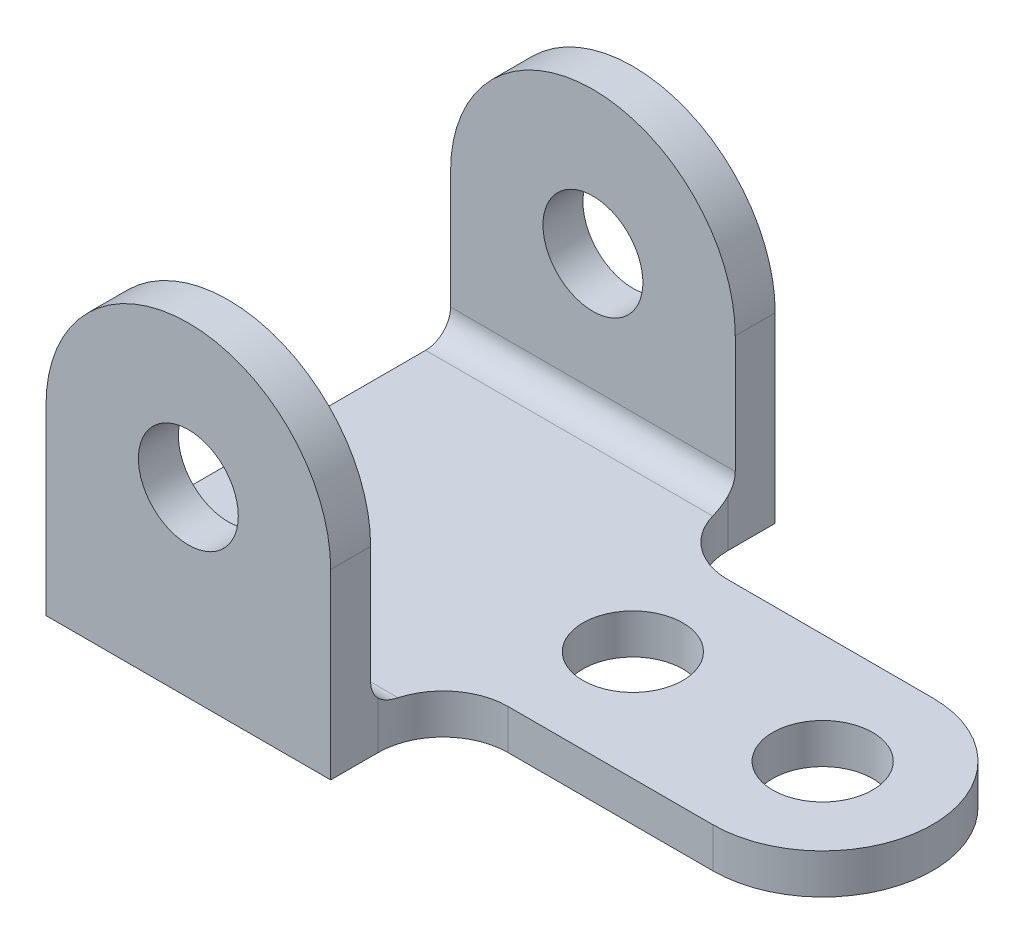
ISO-10303-21;
HEADER;
FILE_DESCRIPTION(('STEP AP214'),'2;1');
FILE_NAME('part.step','',(''),(''),'','','');
FILE_SCHEMA(('AUTOMOTIVE_DESIGN { 1 0 10303 214 1 1 1 1 }'));
ENDSEC;
DATA;
#1=APPLICATION_CONTEXT('core data for automotive mechanical design processes');
#2=APPLICATION_PROTOCOL_DEFINITION('international standard','automotive_design',2000,#1);
#3=PRODUCT_CONTEXT('',#1,'mechanical');
#4=PRODUCT('Part','Part','',(#3));
#5=PRODUCT_RELATED_PRODUCT_CATEGORY('part','',(#4));
#6=PRODUCT_DEFINITION_FORMATION('','',#4);
#7=PRODUCT_DEFINITION_CONTEXT('part definition',#1,'design');
#8=PRODUCT_DEFINITION('design','',#6,#7);
#9=PRODUCT_DEFINITION_SHAPE('','',#8);
#10=(LENGTH_UNIT() NAMED_UNIT(*) SI_UNIT(.MILLI.,.METRE.));
#11=(NAMED_UNIT(*) PLANE_ANGLE_UNIT() SI_UNIT($,.RADIAN.));
#12=(NAMED_UNIT(*) SI_UNIT($,.STERADIAN.) SOLID_ANGLE_UNIT());
#13=UNCERTAINTY_MEASURE_WITH_UNIT(LENGTH_MEASURE(1.E-05),#10,'distance_accuracy_value','');
#14=(GEOMETRIC_REPRESENTATION_CONTEXT(3) GLOBAL_UNCERTAINTY_ASSIGNED_CONTEXT((#13)) GLOBAL_UNIT_ASSIGNED_CONTEXT((#10,
#11,#12)) REPRESENTATION_CONTEXT('',''));
#15=CARTESIAN_POINT('',(0.,0.,0.));
#16=DIRECTION('',(0.,0.,1.));
#17=DIRECTION('',(1.,0.,0.));
#18=AXIS2_PLACEMENT_3D('',#15,#16,#17);
#19=CARTESIAN_POINT('',(70.,8.,-9.49999999999998));
#20=DIRECTION('',(0.,-1.,0.));
#21=DIRECTION('',(0.,0.,-1.));
#22=AXIS2_PLACEMENT_3D('',#19,#20,#21);
#23=PLANE('',#22);
#24=CARTESIAN_POINT('',(111.,8.,-44.5));
#25=DIRECTION('',(0.,1.,0.));
#26=DIRECTION('',(0.,0.,1.));
#27=AXIS2_PLACEMENT_3D('',#24,#25,#26);
#28=CIRCLE('',#27,10.);
#29=CARTESIAN_POINT('',(111.,8.,-34.5));
#30=VERTEX_POINT('',#29);
#31=EDGE_CURVE('E226',#30,#30,#28,.T.);
#32=ORIENTED_EDGE('',*,*,#31,.F.);
#33=EDGE_LOOP('',(#32));
#34=FACE_BOUND('',#33,.T.);
#35=CARTESIAN_POINT('',(73.,8.,-44.5));
#36=DIRECTION('',(0.,1.,0.));
#37=DIRECTION('',(0.,0.,1.));
#38=AXIS2_PLACEMENT_3D('',#35,#36,#37);
#39=CIRCLE('',#38,9.99999999999999);
#40=CARTESIAN_POINT('',(73.,8.,-34.5));
#41=VERTEX_POINT('',#40);
#42=EDGE_CURVE('E234',#41,#41,#39,.T.);
#43=ORIENTED_EDGE('',*,*,#42,.F.);
#44=EDGE_LOOP('',(#43));
#45=FACE_BOUND('',#44,.T.);
#46=CARTESIAN_POINT('',(70.,8.,-79.5));
#47=DIRECTION('',(0.,-1.,0.));
#48=DIRECTION('',(0.,0.,-1.));
#49=AXIS2_PLACEMENT_3D('',#46,#47,#48);
#50=CIRCLE('',#49,13.);
#51=CARTESIAN_POINT('',(70.,8.,-66.5));
#52=VERTEX_POINT('',#51);
#53=CARTESIAN_POINT('',(57.4800159744511,8.,-76.));
#54=VERTEX_POINT('',#53);
#55=EDGE_CURVE('E255',#52,#54,#50,.T.);
#56=ORIENTED_EDGE('',*,*,#55,.T.);
#57=DIRECTION('',(-1.,0.,0.));
#58=VECTOR('',#57,1.);
#59=CARTESIAN_POINT('',(0.,8.,-76.));
#60=LINE('',#59,#58);
#61=CARTESIAN_POINT('',(0.,8.,-76.));
#62=VERTEX_POINT('',#61);
#63=EDGE_CURVE('E331',#54,#62,#60,.T.);
#64=ORIENTED_EDGE('',*,*,#63,.T.);
#65=DIRECTION('',(0.,0.,1.));
#66=VECTOR('',#65,1.);
#67=CARTESIAN_POINT('',(0.,8.,0.));
#68=LINE('',#67,#66);
#69=CARTESIAN_POINT('',(0.,8.,-13.));
#70=VERTEX_POINT('',#69);
#71=EDGE_CURVE('E259',#62,#70,#68,.T.);
#72=ORIENTED_EDGE('',*,*,#71,.T.);
#73=DIRECTION('',(1.,0.,0.));
#74=VECTOR('',#73,1.);
#75=CARTESIAN_POINT('',(70.,8.,-13.));
#76=LINE('',#75,#74);
#77=CARTESIAN_POINT('',(57.4800159744511,8.,-13.));
#78=VERTEX_POINT('',#77);
#79=EDGE_CURVE('E327',#70,#78,#76,.T.);
#80=ORIENTED_EDGE('',*,*,#79,.T.);
#81=CARTESIAN_POINT('',(70.,8.,-9.49999999999998));
#82=DIRECTION('',(0.,-1.,0.));
#83=DIRECTION('',(0.,0.,-1.));
#84=AXIS2_PLACEMENT_3D('',#81,#82,#83);
#85=CIRCLE('',#84,13.);
#86=CARTESIAN_POINT('',(70.,8.,-22.5));
#87=VERTEX_POINT('',#86);
#88=EDGE_CURVE('E242',#78,#87,#85,.T.);
#89=ORIENTED_EDGE('',*,*,#88,.T.);
#90=DIRECTION('',(1.,0.,0.));
#91=VECTOR('',#90,1.);
#92=CARTESIAN_POINT('',(70.,8.,-22.5));
#93=LINE('',#92,#91);
#94=CARTESIAN_POINT('',(111.,8.,-22.5));
#95=VERTEX_POINT('',#94);
#96=EDGE_CURVE('E245',#87,#95,#93,.T.);
#97=ORIENTED_EDGE('',*,*,#96,.T.);
#98=CARTESIAN_POINT('',(111.,8.,-44.5));
#99=DIRECTION('',(0.,1.,0.));
#100=DIRECTION('',(0.,0.,-1.));
#101=AXIS2_PLACEMENT_3D('',#98,#99,#100);
#102=CIRCLE('',#101,22.);
#103=CARTESIAN_POINT('',(111.,8.,-66.5));
#104=VERTEX_POINT('',#103);
#105=EDGE_CURVE('E249',#95,#104,#102,.T.);
#106=ORIENTED_EDGE('',*,*,#105,.T.);
#107=DIRECTION('',(-1.,0.,0.));
#108=VECTOR('',#107,1.);
#109=CARTESIAN_POINT('',(111.,8.,-66.5));
#110=LINE('',#109,#108);
#111=EDGE_CURVE('E252',#104,#52,#110,.T.);
#112=ORIENTED_EDGE('',*,*,#111,.T.);
#113=EDGE_LOOP('',(#56,#64,#72,#80,#89,#97,#106,#112));
#114=FACE_BOUND('',#113,.T.);
#115=ADVANCED_FACE('F44',(#34,#45,#114),#23,.F.);
#116=CARTESIAN_POINT('',(70.,0.,-9.49999999999998));
#117=DIRECTION('',(0.,-1.,0.));
#118=DIRECTION('',(0.,0.,-1.));
#119=AXIS2_PLACEMENT_3D('',#116,#117,#118);
#120=PLANE('',#119);
#121=CARTESIAN_POINT('',(70.,0.,-9.49999999999998));
#122=DIRECTION('',(0.,-1.,0.));
#123=DIRECTION('',(0.,0.,-1.));
#124=AXIS2_PLACEMENT_3D('',#121,#122,#123);
#125=CIRCLE('',#124,13.);
#126=CARTESIAN_POINT('',(57.,0.,-9.49999999999998));
#127=VERTEX_POINT('',#126);
#128=CARTESIAN_POINT('',(70.,0.,-22.5));
#129=VERTEX_POINT('',#128);
#130=EDGE_CURVE('E270',#127,#129,#125,.T.);
#131=ORIENTED_EDGE('',*,*,#130,.F.);
#132=DIRECTION('',(0.,0.,-1.));
#133=VECTOR('',#132,1.);
#134=CARTESIAN_POINT('',(57.,0.,0.));
#135=LINE('',#134,#133);
#136=CARTESIAN_POINT('',(57.,0.,0.));
#137=VERTEX_POINT('',#136);
#138=EDGE_CURVE('E267',#137,#127,#135,.T.);
#139=ORIENTED_EDGE('',*,*,#138,.F.);
#140=DIRECTION('',(1.,0.,0.));
#141=VECTOR('',#140,1.);
#142=CARTESIAN_POINT('',(0.,0.,0.));
#143=LINE('',#142,#141);
#144=CARTESIAN_POINT('',(0.,0.,0.));
#145=VERTEX_POINT('',#144);
#146=EDGE_CURVE('E238',#145,#137,#143,.T.);
#147=ORIENTED_EDGE('',*,*,#146,.F.);
#148=DIRECTION('',(0.,0.,1.));
#149=VECTOR('',#148,1.);
#150=CARTESIAN_POINT('',(0.,0.,0.));
#151=LINE('',#150,#149);
#152=CARTESIAN_POINT('',(0.,0.,-89.));
#153=VERTEX_POINT('',#152);
#154=EDGE_CURVE('E246',#153,#145,#151,.T.);
#155=ORIENTED_EDGE('',*,*,#154,.F.);
#156=DIRECTION('',(-1.,0.,0.));
#157=VECTOR('',#156,1.);
#158=CARTESIAN_POINT('',(57.,0.,-89.));
#159=LINE('',#158,#157);
#160=CARTESIAN_POINT('',(57.,0.,-89.));
#161=VERTEX_POINT('',#160);
#162=EDGE_CURVE('E288',#161,#153,#159,.T.);
#163=ORIENTED_EDGE('',*,*,#162,.F.);
#164=DIRECTION('',(0.,0.,-1.));
#165=VECTOR('',#164,1.);
#166=CARTESIAN_POINT('',(57.,0.,-79.5));
#167=LINE('',#166,#165);
#168=CARTESIAN_POINT('',(57.,0.,-79.5));
#169=VERTEX_POINT('',#168);
#170=EDGE_CURVE('E285',#169,#161,#167,.T.);
#171=ORIENTED_EDGE('',*,*,#170,.F.);
#172=CARTESIAN_POINT('',(70.,0.,-79.5));
#173=DIRECTION('',(0.,-1.,0.));
#174=DIRECTION('',(0.,0.,-1.));
#175=AXIS2_PLACEMENT_3D('',#172,#173,#174);
#176=CIRCLE('',#175,13.);
#177=CARTESIAN_POINT('',(70.,0.,-66.5));
#178=VERTEX_POINT('',#177);
#179=EDGE_CURVE('E282',#178,#169,#176,.T.);
#180=ORIENTED_EDGE('',*,*,#179,.F.);
#181=DIRECTION('',(-1.,0.,0.));
#182=VECTOR('',#181,1.);
#183=CARTESIAN_POINT('',(111.,0.,-66.5));
#184=LINE('',#183,#182);
#185=CARTESIAN_POINT('',(111.,0.,-66.5));
#186=VERTEX_POINT('',#185);
#187=EDGE_CURVE('E279',#186,#178,#184,.T.);
#188=ORIENTED_EDGE('',*,*,#187,.F.);
#189=CARTESIAN_POINT('',(111.,0.,-44.5));
#190=DIRECTION('',(0.,1.,0.));
#191=DIRECTION('',(0.,0.,-1.));
#192=AXIS2_PLACEMENT_3D('',#189,#190,#191);
#193=CIRCLE('',#192,22.);
#194=CARTESIAN_POINT('',(111.,0.,-22.5));
#195=VERTEX_POINT('',#194);
#196=EDGE_CURVE('E276',#195,#186,#193,.T.);
#197=ORIENTED_EDGE('',*,*,#196,.F.);
#198=DIRECTION('',(1.,0.,0.));
#199=VECTOR('',#198,1.);
#200=CARTESIAN_POINT('',(70.,0.,-22.5));
#201=LINE('',#200,#199);
#202=EDGE_CURVE('E273',#129,#195,#201,.T.);
#203=ORIENTED_EDGE('',*,*,#202,.F.);
#204=EDGE_LOOP('',(#131,#139,#147,#155,#163,#171,#180,#188,#197,#203));
#205=FACE_BOUND('',#204,.T.);
#206=CARTESIAN_POINT('',(73.,0.,-44.5));
#207=DIRECTION('',(0.,1.,0.));
#208=DIRECTION('',(0.,0.,1.));
#209=AXIS2_PLACEMENT_3D('',#206,#207,#208);
#210=CIRCLE('',#209,9.99999999999999);
#211=CARTESIAN_POINT('',(73.,0.,-34.5));
#212=VERTEX_POINT('',#211);
#213=EDGE_CURVE('E230',#212,#212,#210,.T.);
#214=ORIENTED_EDGE('',*,*,#213,.T.);
#215=EDGE_LOOP('',(#214));
#216=FACE_BOUND('',#215,.T.);
#217=CARTESIAN_POINT('',(111.,0.,-44.5));
#218=DIRECTION('',(0.,1.,0.));
#219=DIRECTION('',(0.,0.,1.));
#220=AXIS2_PLACEMENT_3D('',#217,#218,#219);
#221=CIRCLE('',#220,10.);
#222=CARTESIAN_POINT('',(111.,0.,-34.5));
#223=VERTEX_POINT('',#222);
#224=EDGE_CURVE('E222',#223,#223,#221,.T.);
#225=ORIENTED_EDGE('',*,*,#224,.T.);
#226=EDGE_LOOP('',(#225));
#227=FACE_BOUND('',#226,.T.);
#228=ADVANCED_FACE('F374',(#205,#216,#227),#120,.T.);
#229=CARTESIAN_POINT('',(0.,8.,0.));
#230=DIRECTION('',(0.,0.,-1.));
#231=DIRECTION('',(-1.,0.,0.));
#232=AXIS2_PLACEMENT_3D('',#229,#230,#231);
#233=PLANE('',#232);
#234=ORIENTED_EDGE('',*,*,#146,.T.);
#235=DIRECTION('',(0.,-1.,0.));
#236=VECTOR('',#235,1.);
#237=CARTESIAN_POINT('',(57.,8.,0.));
#238=LINE('',#237,#236);
#239=CARTESIAN_POINT('',(57.,36.5,0.));
#240=VERTEX_POINT('',#239);
#241=EDGE_CURVE('E323',#240,#137,#238,.T.);
#242=ORIENTED_EDGE('',*,*,#241,.F.);
#243=CARTESIAN_POINT('',(28.5,36.5,0.));
#244=DIRECTION('',(0.,0.,1.));
#245=DIRECTION('',(-1.,0.,0.));
#246=AXIS2_PLACEMENT_3D('',#243,#244,#245);
#247=CIRCLE('',#246,28.5);
#248=CARTESIAN_POINT('',(0.,36.5,0.));
#249=VERTEX_POINT('',#248);
#250=EDGE_CURVE('E199',#240,#249,#247,.T.);
#251=ORIENTED_EDGE('',*,*,#250,.T.);
#252=DIRECTION('',(0.,-1.,0.));
#253=VECTOR('',#252,1.);
#254=CARTESIAN_POINT('',(0.,8.,0.));
#255=LINE('',#254,#253);
#256=EDGE_CURVE('E263',#249,#145,#255,.T.);
#257=ORIENTED_EDGE('',*,*,#256,.T.);
#258=EDGE_LOOP('',(#234,#242,#251,#257));
#259=FACE_BOUND('',#258,.T.);
#260=CARTESIAN_POINT('',(28.5,36.5,0.));
#261=DIRECTION('',(0.,0.,1.));
#262=DIRECTION('',(1.,0.,0.));
#263=AXIS2_PLACEMENT_3D('',#260,#261,#262);
#264=CIRCLE('',#263,10.);
#265=CARTESIAN_POINT('',(38.5,36.5,0.));
#266=VERTEX_POINT('',#265);
#267=EDGE_CURVE('E193',#266,#266,#264,.T.);
#268=ORIENTED_EDGE('',*,*,#267,.F.);
#269=EDGE_LOOP('',(#268));
#270=FACE_BOUND('',#269,.T.);
#271=ADVANCED_FACE('F370',(#259,#270),#233,.F.);
#272=CARTESIAN_POINT('',(57.,8.,0.));
#273=DIRECTION('',(-1.,0.,0.));
#274=DIRECTION('',(0.,0.,1.));
#275=AXIS2_PLACEMENT_3D('',#272,#273,#274);
#276=PLANE('',#275);
#277=DIRECTION('',(0.,-1.,0.));
#278=VECTOR('',#277,1.);
#279=CARTESIAN_POINT('',(57.,8.,-9.49999999999998));
#280=LINE('',#279,#278);
#281=CARTESIAN_POINT('',(57.,9.4292857857286,-9.49999999999998));
#282=VERTEX_POINT('',#281);
#283=EDGE_CURVE('E61',#282,#127,#280,.T.);
#284=ORIENTED_EDGE('',*,*,#283,.F.);
#285=CARTESIAN_POINT('',(57.,13.,-13.));
#286=DIRECTION('',(-1.,0.,0.));
#287=DIRECTION('',(0.,0.,1.));
#288=AXIS2_PLACEMENT_3D('',#285,#286,#287);
#289=CIRCLE('',#288,5.);
#290=CARTESIAN_POINT('',(57.,13.,-8.));
#291=VERTEX_POINT('',#290);
#292=EDGE_CURVE('E54',#282,#291,#289,.T.);
#293=ORIENTED_EDGE('',*,*,#292,.T.);
#294=DIRECTION('',(0.,1.,0.));
#295=VECTOR('',#294,1.);
#296=CARTESIAN_POINT('',(57.,0.,-8.));
#297=LINE('',#296,#295);
#298=CARTESIAN_POINT('',(57.,36.5,-8.));
#299=VERTEX_POINT('',#298);
#300=EDGE_CURVE('E207',#291,#299,#297,.T.);
#301=ORIENTED_EDGE('',*,*,#300,.T.);
#302=DIRECTION('',(0.,0.,1.));
#303=VECTOR('',#302,1.);
#304=CARTESIAN_POINT('',(57.,36.5,-8.));
#305=LINE('',#304,#303);
#306=EDGE_CURVE('E214',#299,#240,#305,.T.);
#307=ORIENTED_EDGE('',*,*,#306,.T.);
#308=ORIENTED_EDGE('',*,*,#241,.T.);
#309=ORIENTED_EDGE('',*,*,#138,.T.);
#310=EDGE_LOOP('',(#284,#293,#301,#307,#308,#309));
#311=FACE_BOUND('',#310,.T.);
#312=ADVANCED_FACE('F373',(#311),#276,.F.);
#313=CARTESIAN_POINT('',(70.,8.,-9.49999999999998));
#314=DIRECTION('',(0.,-1.,0.));
#315=DIRECTION('',(0.,0.,-1.));
#316=AXIS2_PLACEMENT_3D('',#313,#314,#315);
#317=CYLINDRICAL_SURFACE('',#316,13.);
#318=ORIENTED_EDGE('',*,*,#130,.T.);
#319=DIRECTION('',(0.,-1.,0.));
#320=VECTOR('',#319,1.);
#321=CARTESIAN_POINT('',(70.,8.,-22.5));
#322=LINE('',#321,#320);
#323=EDGE_CURVE('E317',#87,#129,#322,.T.);
#324=ORIENTED_EDGE('',*,*,#323,.F.);
#325=ORIENTED_EDGE('',*,*,#88,.F.);
#326=CARTESIAN_POINT('',(57.4800159744511,8.,-13.));
#327=CARTESIAN_POINT('',(57.4437070693889,7.99998201838051,-12.8701883033532));
#328=CARTESIAN_POINT('',(57.409448892017,8.00505500730859,-12.7397873147365));
#329=CARTESIAN_POINT('',(57.3451549449521,8.02552742314849,-12.4787312003989));
#330=CARTESIAN_POINT('',(57.3151199744269,8.04092880135384,-12.3480760313086));
#331=CARTESIAN_POINT('',(57.2594170534837,8.08219531724589,-12.0875318126018));
#332=CARTESIAN_POINT('',(57.2337475640901,8.10805675650986,-11.9576425086461));
#333=CARTESIAN_POINT('',(57.186767771958,8.17023990599043,-11.6996060706792));
#334=CARTESIAN_POINT('',(57.1654569520989,8.20656037409592,-11.5714587316842));
#335=CARTESIAN_POINT('',(57.1270609180552,8.28962395725907,-11.3176751836309));
#336=CARTESIAN_POINT('',(57.1099834325639,8.33638584350459,-11.1920439468231));
#337=CARTESIAN_POINT('',(57.0799049360126,8.44005789072381,-10.9445366076367));
#338=CARTESIAN_POINT('',(57.066903944118,8.49696809940721,-10.8226605229151));
#339=CARTESIAN_POINT('',(57.0447009517215,8.62050448089737,-10.5837889256872));
#340=CARTESIAN_POINT('',(57.0354938687113,8.68711749226125,-10.4667870736619));
#341=CARTESIAN_POINT('',(57.0204848397891,8.82964874875812,-10.2384282287686));
#342=CARTESIAN_POINT('',(57.0146815268686,8.90556324343791,-10.1270689861775));
#343=CARTESIAN_POINT('',(57.006708328966,9.05378008689156,-9.92748961883442));
#344=CARTESIAN_POINT('',(57.0041157258059,9.12482970678788,-9.83835193954567));
#345=CARTESIAN_POINT('',(57.0007617240443,9.27275844404576,-9.66523874069198));
#346=CARTESIAN_POINT('',(56.9999976807424,9.34962897611646,-9.58125593710857));
#347=CARTESIAN_POINT('',(57.,9.4292857857286,-9.49999999999998));
#348=B_SPLINE_CURVE_WITH_KNOTS('',3,(#326,#327,#328,#329,#330,#331,#332,#333,#334,#335,#336,
#337,#338,#339,#340,#341,#342,#343,#344,#345,#346,#347),.UNSPECIFIED.,.F.,.F.,(4,2,2,2,2,2,2,2,
2,2,4),(0.,0.404292017619305,0.808660437735791,1.21288600784359,1.61706359202854,
2.02197372682446,2.42688576525097,2.83125358597271,3.23545889471596,3.57724081598897,
3.91852810838887),.UNSPECIFIED.);
#349=EDGE_CURVE('E354',#78,#282,#348,.T.);
#350=ORIENTED_EDGE('',*,*,#349,.T.);
#351=ORIENTED_EDGE('',*,*,#283,.T.);
#352=EDGE_LOOP('',(#318,#324,#325,#350,#351));
#353=FACE_BOUND('',#352,.T.);
#354=ADVANCED_FACE('F377',(#353),#317,.F.);
#355=CARTESIAN_POINT('',(70.,8.,-22.5));
#356=DIRECTION('',(0.,0.,-1.));
#357=DIRECTION('',(-1.,0.,0.));
#358=AXIS2_PLACEMENT_3D('',#355,#356,#357);
#359=PLANE('',#358);
#360=ORIENTED_EDGE('',*,*,#202,.T.);
#361=DIRECTION('',(0.,-1.,0.));
#362=VECTOR('',#361,1.);
#363=CARTESIAN_POINT('',(111.,8.,-22.5));
#364=LINE('',#363,#362);
#365=EDGE_CURVE('E313',#95,#195,#364,.T.);
#366=ORIENTED_EDGE('',*,*,#365,.F.);
#367=ORIENTED_EDGE('',*,*,#96,.F.);
#368=ORIENTED_EDGE('',*,*,#323,.T.);
#369=EDGE_LOOP('',(#360,#366,#367,#368));
#370=FACE_BOUND('',#369,.T.);
#371=ADVANCED_FACE('F381',(#370),#359,.F.);
#372=CARTESIAN_POINT('',(111.,8.,-44.5));
#373=DIRECTION('',(0.,-1.,0.));
#374=DIRECTION('',(0.,0.,-1.));
#375=AXIS2_PLACEMENT_3D('',#372,#373,#374);
#376=CYLINDRICAL_SURFACE('',#375,22.);
#377=ORIENTED_EDGE('',*,*,#196,.T.);
#378=DIRECTION('',(0.,-1.,0.));
#379=VECTOR('',#378,1.);
#380=CARTESIAN_POINT('',(111.,8.,-66.5));
#381=LINE('',#380,#379);
#382=EDGE_CURVE('E309',#104,#186,#381,.T.);
#383=ORIENTED_EDGE('',*,*,#382,.F.);
#384=ORIENTED_EDGE('',*,*,#105,.F.);
#385=ORIENTED_EDGE('',*,*,#365,.T.);
#386=EDGE_LOOP('',(#377,#383,#384,#385));
#387=FACE_BOUND('',#386,.T.);
#388=ADVANCED_FACE('F385',(#387),#376,.T.);
#389=CARTESIAN_POINT('',(111.,8.,-66.5));
#390=DIRECTION('',(0.,0.,1.));
#391=DIRECTION('',(1.,0.,0.));
#392=AXIS2_PLACEMENT_3D('',#389,#390,#391);
#393=PLANE('',#392);
#394=ORIENTED_EDGE('',*,*,#187,.T.);
#395=DIRECTION('',(0.,-1.,0.));
#396=VECTOR('',#395,1.);
#397=CARTESIAN_POINT('',(70.,8.,-66.5));
#398=LINE('',#397,#396);
#399=EDGE_CURVE('E305',#52,#178,#398,.T.);
#400=ORIENTED_EDGE('',*,*,#399,.F.);
#401=ORIENTED_EDGE('',*,*,#111,.F.);
#402=ORIENTED_EDGE('',*,*,#382,.T.);
#403=EDGE_LOOP('',(#394,#400,#401,#402));
#404=FACE_BOUND('',#403,.T.);
#405=ADVANCED_FACE('F388',(#404),#393,.F.);
#406=CARTESIAN_POINT('',(70.,8.,-79.5));
#407=DIRECTION('',(0.,-1.,0.));
#408=DIRECTION('',(0.,0.,-1.));
#409=AXIS2_PLACEMENT_3D('',#406,#407,#408);
#410=CYLINDRICAL_SURFACE('',#409,13.);
#411=ORIENTED_EDGE('',*,*,#179,.T.);
#412=DIRECTION('',(0.,-1.,0.));
#413=VECTOR('',#412,1.);
#414=CARTESIAN_POINT('',(57.,8.,-79.5));
#415=LINE('',#414,#413);
#416=CARTESIAN_POINT('',(57.,9.42928578572857,-79.5));
#417=VERTEX_POINT('',#416);
#418=EDGE_CURVE('E69',#417,#169,#415,.T.);
#419=ORIENTED_EDGE('',*,*,#418,.F.);
#420=CARTESIAN_POINT('',(57.,9.42928578572857,-79.5));
#421=CARTESIAN_POINT('',(56.9999942708165,9.33490857635169,-79.4037396659912));
#422=CARTESIAN_POINT('',(57.0010687101385,9.24444297785855,-79.3036350607594));
#423=CARTESIAN_POINT('',(57.0058527144742,9.07190082536304,-79.0964764568417));
#424=CARTESIAN_POINT('',(57.0095626462078,8.98982544064879,-78.9894214929208));
#425=CARTESIAN_POINT('',(57.0200918319527,8.83466877182295,-78.7691464814167));
#426=CARTESIAN_POINT('',(57.0269105792248,8.76158602436976,-78.6559274412296));
#427=CARTESIAN_POINT('',(57.0440713056772,8.62490171486545,-78.4241716261635));
#428=CARTESIAN_POINT('',(57.054412938104,8.56129922056953,-78.3056353756479));
#429=CARTESIAN_POINT('',(57.078989278685,8.44388077403766,-78.063942764816));
#430=CARTESIAN_POINT('',(57.093230667632,8.39008188249439,-77.9407787918855));
#431=CARTESIAN_POINT('',(57.1258635158466,8.29272097954416,-77.6910027946656));
#432=CARTESIAN_POINT('',(57.1442549561102,8.24915892126257,-77.5643907861677));
#433=CARTESIAN_POINT('',(57.1853269534918,8.17252521657987,-77.3089113693173));
#434=CARTESIAN_POINT('',(57.2080015008465,8.13943904315177,-77.1800473480218));
#435=CARTESIAN_POINT('',(57.2577116155323,8.08376210851015,-76.9209534330664));
#436=CARTESIAN_POINT('',(57.284745454936,8.06116720249949,-76.7907240996309));
#437=CARTESIAN_POINT('',(57.33861185704,8.02910796116827,-76.5500852995389));
#438=CARTESIAN_POINT('',(57.3648261272009,8.01815122818262,-76.43973251939));
#439=CARTESIAN_POINT('',(57.4202171356414,8.00359855432603,-76.2194507664629));
#440=CARTESIAN_POINT('',(57.4493896322784,7.99999222647815,-76.109521415049));
#441=CARTESIAN_POINT('',(57.4800159744511,7.99999999999999,-76.));
#442=B_SPLINE_CURVE_WITH_KNOTS('',3,(#420,#421,#422,#423,#424,#425,#426,#427,#428,#429,#430,
#431,#432,#433,#434,#435,#436,#437,#438,#439,#440,#441),.UNSPECIFIED.,.F.,.F.,(4,2,2,2,2,2,2,2,
2,2,4),(0.,0.404318788766121,0.808693848146083,1.21300301766613,1.6172724030018,
2.02223873487295,2.42720321236088,2.83160363630476,3.23584415708084,3.57742727670949,
3.91852736407969),.UNSPECIFIED.);
#443=EDGE_CURVE('E346',#417,#54,#442,.T.);
#444=ORIENTED_EDGE('',*,*,#443,.T.);
#445=ORIENTED_EDGE('',*,*,#55,.F.);
#446=ORIENTED_EDGE('',*,*,#399,.T.);
#447=EDGE_LOOP('',(#411,#419,#444,#445,#446));
#448=FACE_BOUND('',#447,.T.);
#449=ADVANCED_FACE('F360',(#448),#410,.F.);
#450=CARTESIAN_POINT('',(57.,8.,-79.5));
#451=DIRECTION('',(-1.,0.,0.));
#452=DIRECTION('',(0.,0.,1.));
#453=AXIS2_PLACEMENT_3D('',#450,#451,#452);
#454=PLANE('',#453);
#455=ORIENTED_EDGE('',*,*,#170,.T.);
#456=DIRECTION('',(0.,-1.,0.));
#457=VECTOR('',#456,1.);
#458=CARTESIAN_POINT('',(57.,8.,-89.));
#459=LINE('',#458,#457);
#460=CARTESIAN_POINT('',(57.,36.5,-89.));
#461=VERTEX_POINT('',#460);
#462=EDGE_CURVE('E299',#461,#161,#459,.T.);
#463=ORIENTED_EDGE('',*,*,#462,.F.);
#464=DIRECTION('',(0.,0.,-1.));
#465=VECTOR('',#464,1.);
#466=CARTESIAN_POINT('',(57.,36.5,-81.));
#467=LINE('',#466,#465);
#468=CARTESIAN_POINT('',(57.,36.5,-81.));
#469=VERTEX_POINT('',#468);
#470=EDGE_CURVE('E180',#469,#461,#467,.T.);
#471=ORIENTED_EDGE('',*,*,#470,.F.);
#472=DIRECTION('',(0.,-1.,0.));
#473=VECTOR('',#472,1.);
#474=CARTESIAN_POINT('',(57.,36.5,-81.));
#475=LINE('',#474,#473);
#476=CARTESIAN_POINT('',(57.,13.,-81.));
#477=VERTEX_POINT('',#476);
#478=EDGE_CURVE('E171',#469,#477,#475,.T.);
#479=ORIENTED_EDGE('',*,*,#478,.T.);
#480=CARTESIAN_POINT('',(57.,13.,-76.));
#481=DIRECTION('',(-1.,0.,0.));
#482=DIRECTION('',(0.,0.,1.));
#483=AXIS2_PLACEMENT_3D('',#480,#481,#482);
#484=CIRCLE('',#483,5.);
#485=EDGE_CURVE('E343',#477,#417,#484,.T.);
#486=ORIENTED_EDGE('',*,*,#485,.T.);
#487=ORIENTED_EDGE('',*,*,#418,.T.);
#488=EDGE_LOOP('',(#455,#463,#471,#479,#486,#487));
#489=FACE_BOUND('',#488,.T.);
#490=ADVANCED_FACE('F396',(#489),#454,.F.);
#491=CARTESIAN_POINT('',(57.,8.,-89.));
#492=DIRECTION('',(0.,0.,1.));
#493=DIRECTION('',(1.,0.,0.));
#494=AXIS2_PLACEMENT_3D('',#491,#492,#493);
#495=PLANE('',#494);
#496=ORIENTED_EDGE('',*,*,#162,.T.);
#497=DIRECTION('',(0.,-1.,0.));
#498=VECTOR('',#497,1.);
#499=CARTESIAN_POINT('',(0.,8.,-89.));
#500=LINE('',#499,#498);
#501=CARTESIAN_POINT('',(0.,36.5,-89.));
#502=VERTEX_POINT('',#501);
#503=EDGE_CURVE('E296',#502,#153,#500,.T.);
#504=ORIENTED_EDGE('',*,*,#503,.F.);
#505=CARTESIAN_POINT('',(28.5,36.5,-89.));
#506=DIRECTION('',(0.,0.,-1.));
#507=DIRECTION('',(-1.,0.,0.));
#508=AXIS2_PLACEMENT_3D('',#505,#506,#507);
#509=CIRCLE('',#508,28.5);
#510=EDGE_CURVE('E178',#502,#461,#509,.T.);
#511=ORIENTED_EDGE('',*,*,#510,.T.);
#512=ORIENTED_EDGE('',*,*,#462,.T.);
#513=EDGE_LOOP('',(#496,#504,#511,#512));
#514=FACE_BOUND('',#513,.T.);
#515=CARTESIAN_POINT('',(28.5,36.5,-89.));
#516=DIRECTION('',(0.,0.,-1.));
#517=DIRECTION('',(-1.,0.,0.));
#518=AXIS2_PLACEMENT_3D('',#515,#516,#517);
#519=CIRCLE('',#518,10.);
#520=CARTESIAN_POINT('',(18.5,36.5,-89.));
#521=VERTEX_POINT('',#520);
#522=EDGE_CURVE('E452',#521,#521,#519,.T.);
#523=ORIENTED_EDGE('',*,*,#522,.F.);
#524=EDGE_LOOP('',(#523));
#525=FACE_BOUND('',#524,.T.);
#526=ADVANCED_FACE('F414',(#514,#525),#495,.F.);
#527=CARTESIAN_POINT('',(0.,8.,0.));
#528=DIRECTION('',(1.,0.,0.));
#529=DIRECTION('',(0.,0.,-1.));
#530=AXIS2_PLACEMENT_3D('',#527,#528,#529);
#531=PLANE('',#530);
#532=ORIENTED_EDGE('',*,*,#154,.T.);
#533=ORIENTED_EDGE('',*,*,#256,.F.);
#534=DIRECTION('',(0.,0.,1.));
#535=VECTOR('',#534,1.);
#536=CARTESIAN_POINT('',(0.,36.5,-8.));
#537=LINE('',#536,#535);
#538=CARTESIAN_POINT('',(0.,36.5,-8.));
#539=VERTEX_POINT('',#538);
#540=EDGE_CURVE('E218',#539,#249,#537,.T.);
#541=ORIENTED_EDGE('',*,*,#540,.F.);
#542=DIRECTION('',(0.,-1.,0.));
#543=VECTOR('',#542,1.);
#544=CARTESIAN_POINT('',(0.,0.,-8.));
#545=LINE('',#544,#543);
#546=CARTESIAN_POINT('',(0.,13.,-8.));
#547=VERTEX_POINT('',#546);
#548=EDGE_CURVE('E203',#539,#547,#545,.T.);
#549=ORIENTED_EDGE('',*,*,#548,.T.);
#550=CARTESIAN_POINT('',(0.,13.,-13.));
#551=DIRECTION('',(1.,0.,0.));
#552=DIRECTION('',(0.,0.,-1.));
#553=AXIS2_PLACEMENT_3D('',#550,#551,#552);
#554=CIRCLE('',#553,5.);
#555=EDGE_CURVE('E11',#547,#70,#554,.T.);
#556=ORIENTED_EDGE('',*,*,#555,.T.);
#557=ORIENTED_EDGE('',*,*,#71,.F.);
#558=CARTESIAN_POINT('',(0.,13.,-76.));
#559=DIRECTION('',(1.,0.,0.));
#560=DIRECTION('',(0.,0.,-1.));
#561=AXIS2_PLACEMENT_3D('',#558,#559,#560);
#562=CIRCLE('',#561,5.);
#563=CARTESIAN_POINT('',(0.,13.,-81.));
#564=VERTEX_POINT('',#563);
#565=EDGE_CURVE('E165',#62,#564,#562,.T.);
#566=ORIENTED_EDGE('',*,*,#565,.T.);
#567=DIRECTION('',(0.,1.,0.));
#568=VECTOR('',#567,1.);
#569=CARTESIAN_POINT('',(0.,8.,-81.));
#570=LINE('',#569,#568);
#571=CARTESIAN_POINT('',(0.,36.5,-81.));
#572=VERTEX_POINT('',#571);
#573=EDGE_CURVE('E158',#564,#572,#570,.T.);
#574=ORIENTED_EDGE('',*,*,#573,.T.);
#575=DIRECTION('',(0.,0.,-1.));
#576=VECTOR('',#575,1.);
#577=CARTESIAN_POINT('',(0.,36.5,-81.));
#578=LINE('',#577,#576);
#579=EDGE_CURVE('E162',#572,#502,#578,.T.);
#580=ORIENTED_EDGE('',*,*,#579,.T.);
#581=ORIENTED_EDGE('',*,*,#503,.T.);
#582=EDGE_LOOP('',(#532,#533,#541,#549,#556,#557,#566,#574,#580,#581));
#583=FACE_BOUND('',#582,.T.);
#584=ADVANCED_FACE('F160',(#583),#531,.F.);
#585=CARTESIAN_POINT('',(73.,8.,-44.5));
#586=DIRECTION('',(0.,-1.,0.));
#587=DIRECTION('',(0.,0.,-1.));
#588=AXIS2_PLACEMENT_3D('',#585,#586,#587);
#589=CYLINDRICAL_SURFACE('',#588,9.99999999999999);
#590=ORIENTED_EDGE('',*,*,#42,.T.);
#591=EDGE_LOOP('',(#590));
#592=FACE_BOUND('',#591,.T.);
#593=ORIENTED_EDGE('',*,*,#213,.F.);
#594=EDGE_LOOP('',(#593));
#595=FACE_BOUND('',#594,.T.);
#596=ADVANCED_FACE('F409',(#592,#595),#589,.F.);
#597=CARTESIAN_POINT('',(111.,8.,-44.5));
#598=DIRECTION('',(0.,-1.,0.));
#599=DIRECTION('',(0.,0.,-1.));
#600=AXIS2_PLACEMENT_3D('',#597,#598,#599);
#601=CYLINDRICAL_SURFACE('',#600,10.);
#602=ORIENTED_EDGE('',*,*,#31,.T.);
#603=EDGE_LOOP('',(#602));
#604=FACE_BOUND('',#603,.T.);
#605=ORIENTED_EDGE('',*,*,#224,.F.);
#606=EDGE_LOOP('',(#605));
#607=FACE_BOUND('',#606,.T.);
#608=ADVANCED_FACE('F477',(#604,#607),#601,.F.);
#609=CARTESIAN_POINT('',(28.5,36.5,-8.));
#610=DIRECTION('',(0.,0.,-1.));
#611=DIRECTION('',(-1.,0.,0.));
#612=AXIS2_PLACEMENT_3D('',#609,#610,#611);
#613=PLANE('',#612);
#614=CARTESIAN_POINT('',(28.5,36.5,-8.));
#615=DIRECTION('',(0.,0.,1.));
#616=DIRECTION('',(1.,0.,0.));
#617=AXIS2_PLACEMENT_3D('',#614,#615,#616);
#618=CIRCLE('',#617,10.);
#619=CARTESIAN_POINT('',(38.5,36.5,-8.));
#620=VERTEX_POINT('',#619);
#621=EDGE_CURVE('E195',#620,#620,#618,.T.);
#622=ORIENTED_EDGE('',*,*,#621,.T.);
#623=EDGE_LOOP('',(#622));
#624=FACE_BOUND('',#623,.T.);
#625=ORIENTED_EDGE('',*,*,#300,.F.);
#626=DIRECTION('',(1.,0.,0.));
#627=VECTOR('',#626,1.);
#628=CARTESIAN_POINT('',(28.5,13.,-8.));
#629=LINE('',#628,#627);
#630=EDGE_CURVE('E338',#291,#547,#629,.F.);
#631=ORIENTED_EDGE('',*,*,#630,.T.);
#632=ORIENTED_EDGE('',*,*,#548,.F.);
#633=CARTESIAN_POINT('',(28.5,36.5,-8.));
#634=DIRECTION('',(0.,0.,1.));
#635=DIRECTION('',(-1.,0.,0.));
#636=AXIS2_PLACEMENT_3D('',#633,#634,#635);
#637=CIRCLE('',#636,28.5);
#638=EDGE_CURVE('E210',#299,#539,#637,.T.);
#639=ORIENTED_EDGE('',*,*,#638,.F.);
#640=EDGE_LOOP('',(#625,#631,#632,#639));
#641=FACE_BOUND('',#640,.T.);
#642=ADVANCED_FACE('F439',(#624,#641),#613,.T.);
#643=CARTESIAN_POINT('',(28.5,36.5,-8.));
#644=DIRECTION('',(0.,0.,1.));
#645=DIRECTION('',(1.,0.,0.));
#646=AXIS2_PLACEMENT_3D('',#643,#644,#645);
#647=CYLINDRICAL_SURFACE('',#646,28.5);
#648=ORIENTED_EDGE('',*,*,#250,.F.);
#649=ORIENTED_EDGE('',*,*,#306,.F.);
#650=ORIENTED_EDGE('',*,*,#638,.T.);
#651=ORIENTED_EDGE('',*,*,#540,.T.);
#652=EDGE_LOOP('',(#648,#649,#650,#651));
#653=FACE_BOUND('',#652,.T.);
#654=ADVANCED_FACE('F433',(#653),#647,.T.);
#655=CARTESIAN_POINT('',(28.5,36.5,-8.));
#656=DIRECTION('',(0.,0.,1.));
#657=DIRECTION('',(1.,0.,0.));
#658=AXIS2_PLACEMENT_3D('',#655,#656,#657);
#659=CYLINDRICAL_SURFACE('',#658,10.);
#660=ORIENTED_EDGE('',*,*,#621,.F.);
#661=EDGE_LOOP('',(#660));
#662=FACE_BOUND('',#661,.T.);
#663=ORIENTED_EDGE('',*,*,#267,.T.);
#664=EDGE_LOOP('',(#663));
#665=FACE_BOUND('',#664,.T.);
#666=ADVANCED_FACE('F471',(#662,#665),#659,.F.);
#667=CARTESIAN_POINT('',(28.5,36.5,-81.));
#668=DIRECTION('',(0.,0.,-1.));
#669=DIRECTION('',(-1.,0.,0.));
#670=AXIS2_PLACEMENT_3D('',#667,#668,#669);
#671=CYLINDRICAL_SURFACE('',#670,28.5);
#672=ORIENTED_EDGE('',*,*,#510,.F.);
#673=ORIENTED_EDGE('',*,*,#579,.F.);
#674=CARTESIAN_POINT('',(28.5,36.5,-81.));
#675=DIRECTION('',(0.,0.,-1.));
#676=DIRECTION('',(-1.,0.,0.));
#677=AXIS2_PLACEMENT_3D('',#674,#675,#676);
#678=CIRCLE('',#677,28.5);
#679=EDGE_CURVE('E170',#572,#469,#678,.T.);
#680=ORIENTED_EDGE('',*,*,#679,.T.);
#681=ORIENTED_EDGE('',*,*,#470,.T.);
#682=EDGE_LOOP('',(#672,#673,#680,#681));
#683=FACE_BOUND('',#682,.T.);
#684=ADVANCED_FACE('F175',(#683),#671,.T.);
#685=CARTESIAN_POINT('',(28.5,36.5,-81.));
#686=DIRECTION('',(0.,0.,-1.));
#687=DIRECTION('',(-1.,0.,0.));
#688=AXIS2_PLACEMENT_3D('',#685,#686,#687);
#689=PLANE('',#688);
#690=CARTESIAN_POINT('',(28.5,36.5,-81.));
#691=DIRECTION('',(0.,0.,-1.));
#692=DIRECTION('',(-1.,0.,0.));
#693=AXIS2_PLACEMENT_3D('',#690,#691,#692);
#694=CIRCLE('',#693,10.);
#695=CARTESIAN_POINT('',(18.5,36.5,-81.));
#696=VERTEX_POINT('',#695);
#697=EDGE_CURVE('E191',#696,#696,#694,.T.);
#698=ORIENTED_EDGE('',*,*,#697,.T.);
#699=EDGE_LOOP('',(#698));
#700=FACE_BOUND('',#699,.T.);
#701=ORIENTED_EDGE('',*,*,#573,.F.);
#702=DIRECTION('',(-1.,0.,0.));
#703=VECTOR('',#702,1.);
#704=CARTESIAN_POINT('',(57.,13.,-81.));
#705=LINE('',#704,#703);
#706=EDGE_CURVE('E335',#564,#477,#705,.F.);
#707=ORIENTED_EDGE('',*,*,#706,.T.);
#708=ORIENTED_EDGE('',*,*,#478,.F.);
#709=ORIENTED_EDGE('',*,*,#679,.F.);
#710=EDGE_LOOP('',(#701,#707,#708,#709));
#711=FACE_BOUND('',#710,.T.);
#712=ADVANCED_FACE('F183',(#700,#711),#689,.F.);
#713=CARTESIAN_POINT('',(28.5,36.5,-81.));
#714=DIRECTION('',(0.,0.,-1.));
#715=DIRECTION('',(-1.,0.,0.));
#716=AXIS2_PLACEMENT_3D('',#713,#714,#715);
#717=CYLINDRICAL_SURFACE('',#716,10.);
#718=ORIENTED_EDGE('',*,*,#697,.F.);
#719=EDGE_LOOP('',(#718));
#720=FACE_BOUND('',#719,.T.);
#721=ORIENTED_EDGE('',*,*,#522,.T.);
#722=EDGE_LOOP('',(#721));
#723=FACE_BOUND('',#722,.T.);
#724=ADVANCED_FACE('F368',(#720,#723),#717,.F.);
#725=CARTESIAN_POINT('',(70.,13.,-76.));
#726=DIRECTION('',(1.,0.,0.));
#727=DIRECTION('',(0.,0.,-1.));
#728=AXIS2_PLACEMENT_3D('',#725,#726,#727);
#729=CYLINDRICAL_SURFACE('',#728,5.);
#730=ORIENTED_EDGE('',*,*,#485,.F.);
#731=ORIENTED_EDGE('',*,*,#706,.F.);
#732=ORIENTED_EDGE('',*,*,#565,.F.);
#733=ORIENTED_EDGE('',*,*,#63,.F.);
#734=ORIENTED_EDGE('',*,*,#443,.F.);
#735=EDGE_LOOP('',(#730,#731,#732,#733,#734));
#736=FACE_BOUND('',#735,.T.);
#737=ADVANCED_FACE('F364',(#736),#729,.F.);
#738=CARTESIAN_POINT('',(70.,13.,-13.));
#739=DIRECTION('',(1.,0.,0.));
#740=DIRECTION('',(0.,0.,-1.));
#741=AXIS2_PLACEMENT_3D('',#738,#739,#740);
#742=CYLINDRICAL_SURFACE('',#741,5.);
#743=ORIENTED_EDGE('',*,*,#555,.F.);
#744=ORIENTED_EDGE('',*,*,#630,.F.);
#745=ORIENTED_EDGE('',*,*,#292,.F.);
#746=ORIENTED_EDGE('',*,*,#349,.F.);
#747=ORIENTED_EDGE('',*,*,#79,.F.);
#748=EDGE_LOOP('',(#743,#744,#745,#746,#747));
#749=FACE_BOUND('',#748,.T.);
#750=ADVANCED_FACE('F46',(#749),#742,.F.);
#751=CLOSED_SHELL('',(#115,#228,#271,#312,#354,#371,#388,#405,#449,#490,#526,#584,#596,#608,
#642,#654,#666,#684,#712,#724,#737,#750));
#752=MANIFOLD_SOLID_BREP('B2',#751);
#753=ADVANCED_BREP_SHAPE_REPRESENTATION('',(#18,#752),#14);
#754=SHAPE_DEFINITION_REPRESENTATION(#9,#753);
ENDSEC;
END-ISO-10303-21;
